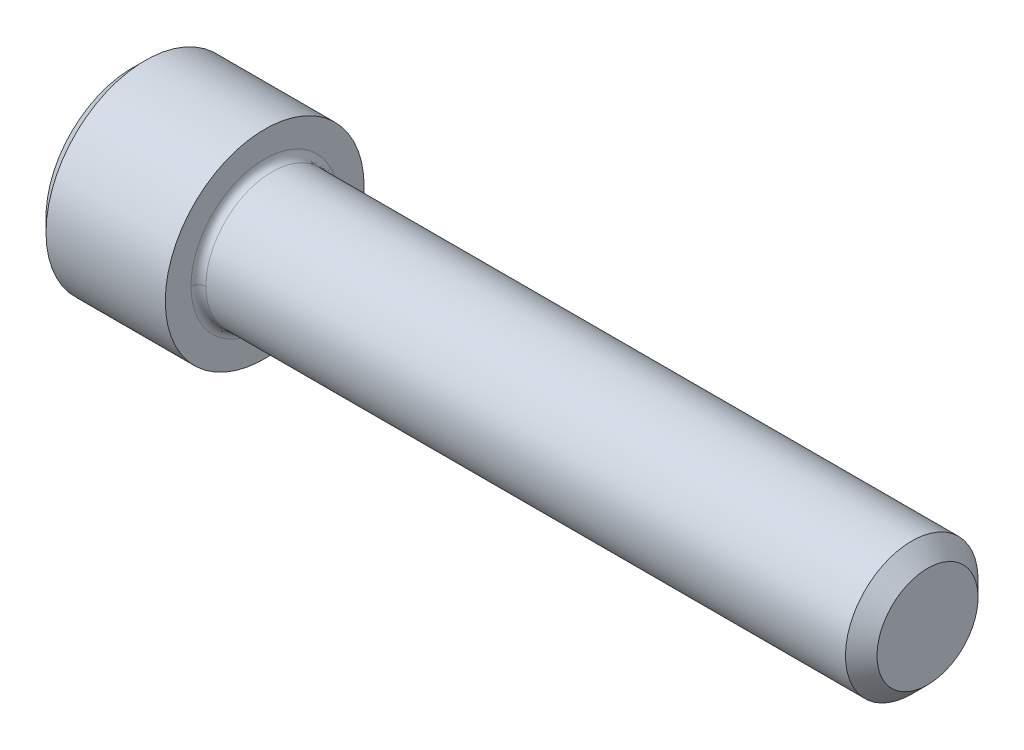
ISO-10303-21;
HEADER;
FILE_DESCRIPTION(('STEP AP214'),'2;1');
FILE_NAME('part.step','',(''),(''),'','','');
FILE_SCHEMA(('AUTOMOTIVE_DESIGN { 1 0 10303 214 1 1 1 1 }'));
ENDSEC;
DATA;
#1=APPLICATION_CONTEXT('core data for automotive mechanical design processes');
#2=APPLICATION_PROTOCOL_DEFINITION('international standard','automotive_design',2000,#1);
#3=PRODUCT_CONTEXT('',#1,'mechanical');
#4=PRODUCT('Part','Part','',(#3));
#5=PRODUCT_RELATED_PRODUCT_CATEGORY('part','',(#4));
#6=PRODUCT_DEFINITION_FORMATION('','',#4);
#7=PRODUCT_DEFINITION_CONTEXT('part definition',#1,'design');
#8=PRODUCT_DEFINITION('design','',#6,#7);
#9=PRODUCT_DEFINITION_SHAPE('','',#8);
#10=(LENGTH_UNIT() NAMED_UNIT(*) SI_UNIT(.MILLI.,.METRE.));
#11=(NAMED_UNIT(*) PLANE_ANGLE_UNIT() SI_UNIT($,.RADIAN.));
#12=(NAMED_UNIT(*) SI_UNIT($,.STERADIAN.) SOLID_ANGLE_UNIT());
#13=UNCERTAINTY_MEASURE_WITH_UNIT(LENGTH_MEASURE(1.E-05),#10,'distance_accuracy_value','');
#14=(GEOMETRIC_REPRESENTATION_CONTEXT(3) GLOBAL_UNCERTAINTY_ASSIGNED_CONTEXT((#13)) GLOBAL_UNIT_ASSIGNED_CONTEXT((#10,
#11,#12)) REPRESENTATION_CONTEXT('',''));
#15=CARTESIAN_POINT('',(0.,0.,0.));
#16=DIRECTION('',(0.,0.,1.));
#17=DIRECTION('',(1.,0.,0.));
#18=AXIS2_PLACEMENT_3D('',#15,#16,#17);
#19=CARTESIAN_POINT('',(38.1,-2.4483822,2.4483822));
#20=DIRECTION('',(1.,0.,0.));
#21=DIRECTION('',(0.,0.,-1.));
#22=AXIS2_PLACEMENT_3D('',#19,#20,#21);
#23=PLANE('',#22);
#24=CARTESIAN_POINT('',(38.1,0.,0.));
#25=DIRECTION('',(-1.,0.,0.));
#26=DIRECTION('',(0.,-1.,0.));
#27=AXIS2_PLACEMENT_3D('',#24,#25,#26);
#28=CIRCLE('',#27,2.41934999999998);
#29=CARTESIAN_POINT('',(38.1,-2.41934999999998,0.));
#30=VERTEX_POINT('',#29);
#31=EDGE_CURVE('E20',#30,#30,#28,.F.);
#32=ORIENTED_EDGE('',*,*,#31,.T.);
#33=EDGE_LOOP('',(#32));
#34=FACE_BOUND('',#33,.T.);
#35=ADVANCED_FACE('F16',(#34),#23,.T.);
#36=CARTESIAN_POINT('',(38.1,0.,0.));
#37=DIRECTION('',(-1.,0.,0.));
#38=DIRECTION('',(0.,-1.,0.));
#39=AXIS2_PLACEMENT_3D('',#36,#37,#38);
#40=CONICAL_SURFACE('',#39,2.41935,0.785398163397446);
#41=CARTESIAN_POINT('',(37.34435,0.,0.));
#42=DIRECTION('',(-1.,0.,0.));
#43=DIRECTION('',(0.,0.,1.));
#44=AXIS2_PLACEMENT_3D('',#41,#42,#43);
#45=CIRCLE('',#44,3.175);
#46=CARTESIAN_POINT('',(37.34435,0.,3.175));
#47=VERTEX_POINT('',#46);
#48=EDGE_CURVE('E239',#47,#47,#45,.F.);
#49=ORIENTED_EDGE('',*,*,#48,.T.);
#50=EDGE_LOOP('',(#49));
#51=FACE_BOUND('',#50,.T.);
#52=ORIENTED_EDGE('',*,*,#31,.F.);
#53=EDGE_LOOP('',(#52));
#54=FACE_BOUND('',#53,.T.);
#55=ADVANCED_FACE('F308',(#51,#54),#40,.T.);
#56=CARTESIAN_POINT('',(37.34435,0.,0.));
#57=DIRECTION('',(-1.,0.,0.));
#58=DIRECTION('',(0.,0.,1.));
#59=AXIS2_PLACEMENT_3D('',#56,#57,#58);
#60=CYLINDRICAL_SURFACE('',#59,3.175);
#61=CARTESIAN_POINT('',(6.70559999986134,0.,0.));
#62=DIRECTION('',(1.,0.,0.));
#63=DIRECTION('',(0.,0.,-1.));
#64=AXIS2_PLACEMENT_3D('',#61,#62,#63);
#65=CIRCLE('',#64,3.17500000019002);
#66=CARTESIAN_POINT('',(6.70559999986134,-3.25601692768088E-10,-3.17500000014251));
#67=VERTEX_POINT('',#66);
#68=CARTESIAN_POINT('',(6.705599999896,0.,3.17500000014251));
#69=VERTEX_POINT('',#68);
#70=EDGE_CURVE('E242',#67,#69,#65,.T.);
#71=ORIENTED_EDGE('',*,*,#70,.T.);
#72=CARTESIAN_POINT('',(6.70559999986134,0.,0.));
#73=DIRECTION('',(1.,0.,0.));
#74=DIRECTION('',(0.,0.,-1.));
#75=AXIS2_PLACEMENT_3D('',#72,#73,#74);
#76=CIRCLE('',#75,3.17500000019002);
#77=EDGE_CURVE('E231',#69,#67,#76,.T.);
#78=ORIENTED_EDGE('',*,*,#77,.T.);
#79=EDGE_LOOP('',(#71,#78));
#80=FACE_BOUND('',#79,.T.);
#81=ORIENTED_EDGE('',*,*,#48,.F.);
#82=EDGE_LOOP('',(#81));
#83=FACE_BOUND('',#82,.T.);
#84=ADVANCED_FACE('F216',(#80,#83),#60,.T.);
#85=CARTESIAN_POINT('',(6.351776519,0.,3.566100763));
#86=CARTESIAN_POINT('',(6.351776519,-7.132201526,3.566100763));
#87=CARTESIAN_POINT('',(6.351776519,-7.132201526,-3.566100763));
#88=CARTESIAN_POINT('',(6.351776519,0.,-3.566100763));
#89=CARTESIAN_POINT('',(6.327518818,0.,3.324332881));
#90=CARTESIAN_POINT('',(6.327518818,-6.648665762,3.324332881));
#91=CARTESIAN_POINT('',(6.327518818,-6.648665762,-3.324332881));
#92=CARTESIAN_POINT('',(6.327518818,0.,-3.324332881));
#93=CARTESIAN_POINT('',(6.499332881,0.,3.152518818));
#94=CARTESIAN_POINT('',(6.499332881,-6.305037635,3.152518818));
#95=CARTESIAN_POINT('',(6.499332881,-6.305037635,-3.152518818));
#96=CARTESIAN_POINT('',(6.499332881,0.,-3.152518818));
#97=CARTESIAN_POINT('',(6.741100763,0.,3.176776519));
#98=CARTESIAN_POINT('',(6.741100763,-6.353553038,3.176776519));
#99=CARTESIAN_POINT('',(6.741100763,-6.353553038,-3.176776519));
#100=CARTESIAN_POINT('',(6.741100763,0.,-3.176776519));
#101=(BOUNDED_SURFACE() B_SPLINE_SURFACE(3,3,((#85,#86,#87,#88),(#89,#90,#91,#92),(#93,#94,#95,
#96),(#97,#98,#99,#100)),.UNSPECIFIED.,.F.,.F.,.F.) B_SPLINE_SURFACE_WITH_KNOTS((4,4),(4,4),(0.,
1.),(0.,1.),.UNSPECIFIED.) GEOMETRIC_REPRESENTATION_ITEM() RATIONAL_B_SPLINE_SURFACE(((1.,
0.333333333333333,0.333333333333333,1.),(0.755320871117972,0.251773623705991,0.251773623705991,
0.755320871117972),(0.755320871117972,0.251773623705991,0.251773623705991,0.755320871117972),
(1.,0.333333333333333,0.333333333333333,1.))) REPRESENTATION_ITEM('') SURFACE());
#102=CARTESIAN_POINT('',(6.351776519,0.,3.566100763));
#103=CARTESIAN_POINT('',(6.327518818,0.,3.324332881));
#104=CARTESIAN_POINT('',(6.499332881,0.,3.152518818));
#105=CARTESIAN_POINT('',(6.741100763,0.,3.176776519));
#106=(BOUNDED_CURVE() B_SPLINE_CURVE(3,(#102,#103,#104,#105),.UNSPECIFIED.,.F.,
.F.) B_SPLINE_CURVE_WITH_KNOTS((4,4),(0.,1.),
.UNSPECIFIED.) CURVE() GEOMETRIC_REPRESENTATION_ITEM() RATIONAL_B_SPLINE_CURVE((1.,
0.755320871117972,0.755320871117972,1.)) REPRESENTATION_ITEM(''));
#107=CARTESIAN_POINT('',(6.35000000011401,0.,3.53060000088287));
#108=VERTEX_POINT('',#107);
#109=EDGE_CURVE('E188',#69,#108,#106,.F.);
#110=CARTESIAN_POINT('',(6.35000000019002,0.,3.53059999986352));
#111=CARTESIAN_POINT('',(6.35000000019002,-7.06119999971818,3.53059999986352));
#112=CARTESIAN_POINT('',(6.35000000019002,-7.06119999971818,-3.53059999986352));
#113=CARTESIAN_POINT('',(6.35000000019002,0.,-3.53059999986352));
#114=(BOUNDED_CURVE() B_SPLINE_CURVE(3,(#110,#111,#112,#113),.UNSPECIFIED.,.F.,
.F.) B_SPLINE_CURVE_WITH_KNOTS((4,4),(0.,1.),
.UNSPECIFIED.) CURVE() GEOMETRIC_REPRESENTATION_ITEM() RATIONAL_B_SPLINE_CURVE((0.956578302168424,
0.318859434056141,0.318859434056141,0.956578302168424)) REPRESENTATION_ITEM(''));
#115=CARTESIAN_POINT('',(6.35000000011401,0.,-3.53060000088287));
#116=VERTEX_POINT('',#115);
#117=EDGE_CURVE('E251',#116,#108,#114,.F.);
#118=CARTESIAN_POINT('',(6.351776519,0.,-3.566100763));
#119=CARTESIAN_POINT('',(6.327518818,0.,-3.324332881));
#120=CARTESIAN_POINT('',(6.499332881,0.,-3.152518818));
#121=CARTESIAN_POINT('',(6.741100763,0.,-3.176776519));
#122=(BOUNDED_CURVE() B_SPLINE_CURVE(3,(#118,#119,#120,#121),.UNSPECIFIED.,.F.,
.F.) B_SPLINE_CURVE_WITH_KNOTS((4,4),(0.,1.),
.UNSPECIFIED.) CURVE() GEOMETRIC_REPRESENTATION_ITEM() RATIONAL_B_SPLINE_CURVE((1.,
0.755320871117972,0.755320871117972,1.)) REPRESENTATION_ITEM(''));
#123=EDGE_CURVE('E238',#116,#67,#122,.T.);
#124=ORIENTED_EDGE('',*,*,#109,.T.);
#125=ORIENTED_EDGE('',*,*,#117,.F.);
#126=ORIENTED_EDGE('',*,*,#123,.T.);
#127=ORIENTED_EDGE('',*,*,#77,.F.);
#128=EDGE_LOOP('',(#124,#125,#126,#127));
#129=FACE_BOUND('',#128,.T.);
#130=ADVANCED_FACE('F203',(#129),#101,.F.);
#131=CARTESIAN_POINT('',(6.351776519,0.,-3.566100763));
#132=CARTESIAN_POINT('',(6.351776519,7.132201526,-3.566100763));
#133=CARTESIAN_POINT('',(6.351776519,7.132201526,3.566100763));
#134=CARTESIAN_POINT('',(6.351776519,0.,3.566100763));
#135=CARTESIAN_POINT('',(6.327518818,0.,-3.324332881));
#136=CARTESIAN_POINT('',(6.327518818,6.648665762,-3.324332881));
#137=CARTESIAN_POINT('',(6.327518818,6.648665762,3.324332881));
#138=CARTESIAN_POINT('',(6.327518818,0.,3.324332881));
#139=CARTESIAN_POINT('',(6.499332881,0.,-3.152518818));
#140=CARTESIAN_POINT('',(6.499332881,6.305037635,-3.152518818));
#141=CARTESIAN_POINT('',(6.499332881,6.305037635,3.152518818));
#142=CARTESIAN_POINT('',(6.499332881,0.,3.152518818));
#143=CARTESIAN_POINT('',(6.741100763,0.,-3.176776519));
#144=CARTESIAN_POINT('',(6.741100763,6.353553038,-3.176776519));
#145=CARTESIAN_POINT('',(6.741100763,6.353553038,3.176776519));
#146=CARTESIAN_POINT('',(6.741100763,0.,3.176776519));
#147=(BOUNDED_SURFACE() B_SPLINE_SURFACE(3,3,((#131,#132,#133,#134),(#135,#136,#137,#138),(#139,
#140,#141,#142),(#143,#144,#145,#146)),.UNSPECIFIED.,.F.,.F.,
.F.) B_SPLINE_SURFACE_WITH_KNOTS((4,4),(4,4),(0.,1.),(0.,1.),
.UNSPECIFIED.) GEOMETRIC_REPRESENTATION_ITEM() RATIONAL_B_SPLINE_SURFACE(((1.,0.333333333333333,
0.333333333333333,1.),(0.755320871117972,0.251773623705991,0.251773623705991,0.755320871117972),
(0.755320871117972,0.251773623705991,0.251773623705991,0.755320871117972),(1.,0.333333333333333,
0.333333333333333,1.))) REPRESENTATION_ITEM('') SURFACE());
#148=CARTESIAN_POINT('',(6.35000000019002,0.,-3.53059999986352));
#149=CARTESIAN_POINT('',(6.35000000019002,7.06119999971819,-3.53059999986352));
#150=CARTESIAN_POINT('',(6.35000000019002,7.06119999971819,3.53059999986352));
#151=CARTESIAN_POINT('',(6.35000000019002,0.,3.53059999986352));
#152=(BOUNDED_CURVE() B_SPLINE_CURVE(3,(#148,#149,#150,#151),.UNSPECIFIED.,.F.,
.F.) B_SPLINE_CURVE_WITH_KNOTS((4,4),(0.,1.),
.UNSPECIFIED.) CURVE() GEOMETRIC_REPRESENTATION_ITEM() RATIONAL_B_SPLINE_CURVE((0.956578302168424,
0.318859434056141,0.318859434056141,0.956578302168424)) REPRESENTATION_ITEM(''));
#153=EDGE_CURVE('E183',#108,#116,#152,.F.);
#154=ORIENTED_EDGE('',*,*,#70,.F.);
#155=ORIENTED_EDGE('',*,*,#123,.F.);
#156=ORIENTED_EDGE('',*,*,#153,.F.);
#157=ORIENTED_EDGE('',*,*,#109,.F.);
#158=EDGE_LOOP('',(#154,#155,#156,#157));
#159=FACE_BOUND('',#158,.T.);
#160=ADVANCED_FACE('F190',(#159),#147,.F.);
#161=CARTESIAN_POINT('',(6.35,-4.81965,4.81965));
#162=DIRECTION('',(1.,0.,0.));
#163=DIRECTION('',(0.,0.,-1.));
#164=AXIS2_PLACEMENT_3D('',#161,#162,#163);
#165=PLANE('',#164);
#166=ORIENTED_EDGE('',*,*,#117,.T.);
#167=ORIENTED_EDGE('',*,*,#153,.T.);
#168=EDGE_LOOP('',(#166,#167));
#169=FACE_BOUND('',#168,.T.);
#170=CARTESIAN_POINT('',(6.35,0.,0.));
#171=DIRECTION('',(-1.,0.,0.));
#172=DIRECTION('',(0.,0.,1.));
#173=AXIS2_PLACEMENT_3D('',#170,#171,#172);
#174=CIRCLE('',#173,4.7625);
#175=CARTESIAN_POINT('',(6.35,0.,4.7625));
#176=VERTEX_POINT('',#175);
#177=EDGE_CURVE('E177',#176,#176,#174,.F.);
#178=ORIENTED_EDGE('',*,*,#177,.T.);
#179=EDGE_LOOP('',(#178));
#180=FACE_BOUND('',#179,.T.);
#181=ADVANCED_FACE('F202',(#169,#180),#165,.T.);
#182=CARTESIAN_POINT('',(6.35,0.,0.));
#183=DIRECTION('',(-1.,0.,0.));
#184=DIRECTION('',(0.,0.,1.));
#185=AXIS2_PLACEMENT_3D('',#182,#183,#184);
#186=CYLINDRICAL_SURFACE('',#185,4.7625);
#187=CARTESIAN_POINT('',(0.634999999999941,0.,0.));
#188=DIRECTION('',(1.,0.,0.));
#189=DIRECTION('',(0.,0.,-1.));
#190=AXIS2_PLACEMENT_3D('',#187,#188,#189);
#191=CIRCLE('',#190,4.7625);
#192=CARTESIAN_POINT('',(0.635,0.,-4.7625));
#193=VERTEX_POINT('',#192);
#194=EDGE_CURVE('E155',#193,#193,#191,.T.);
#195=ORIENTED_EDGE('',*,*,#194,.T.);
#196=EDGE_LOOP('',(#195));
#197=FACE_BOUND('',#196,.T.);
#198=ORIENTED_EDGE('',*,*,#177,.F.);
#199=EDGE_LOOP('',(#198));
#200=FACE_BOUND('',#199,.T.);
#201=ADVANCED_FACE('F204',(#197,#200),#186,.T.);
#202=CARTESIAN_POINT('',(0.,0.,0.));
#203=DIRECTION('',(1.,0.,0.));
#204=DIRECTION('',(0.,0.,-1.));
#205=AXIS2_PLACEMENT_3D('',#202,#203,#204);
#206=CONICAL_SURFACE('',#205,4.1275,0.785398163397449);
#207=ORIENTED_EDGE('',*,*,#194,.F.);
#208=EDGE_LOOP('',(#207));
#209=FACE_BOUND('',#208,.T.);
#210=CARTESIAN_POINT('',(0.,0.,0.));
#211=DIRECTION('',(1.,0.,0.));
#212=DIRECTION('',(0.,0.,-1.));
#213=AXIS2_PLACEMENT_3D('',#210,#211,#212);
#214=CIRCLE('',#213,4.1275);
#215=CARTESIAN_POINT('',(0.,0.,-4.1275));
#216=VERTEX_POINT('',#215);
#217=EDGE_CURVE('E297',#216,#216,#214,.F.);
#218=ORIENTED_EDGE('',*,*,#217,.F.);
#219=EDGE_LOOP('',(#218));
#220=FACE_BOUND('',#219,.T.);
#221=ADVANCED_FACE('F326',(#209,#220),#206,.T.);
#222=CARTESIAN_POINT('',(0.,1.374815329,2.38125));
#223=DIRECTION('',(0.,-0.866025403864407,-0.499999999861491));
#224=DIRECTION('',(0.,0.499999999861491,-0.866025403864407));
#225=AXIS2_PLACEMENT_3D('',#222,#223,#224);
#226=PLANE('',#225);
#227=DIRECTION('',(0.,-0.499999999861491,0.866025403864407));
#228=VECTOR('',#227,1.);
#229=CARTESIAN_POINT('',(3.048,2.062222993,1.190625));
#230=LINE('',#229,#228);
#231=CARTESIAN_POINT('',(3.048,2.06222299282923,1.1906250000894));
#232=VERTEX_POINT('',#231);
#233=CARTESIAN_POINT('',(3.048,1.374815329,2.38125));
#234=VERTEX_POINT('',#233);
#235=EDGE_CURVE('E154',#232,#234,#230,.T.);
#236=ORIENTED_EDGE('',*,*,#235,.T.);
#237=DIRECTION('',(-1.,0.,0.));
#238=VECTOR('',#237,1.);
#239=CARTESIAN_POINT('',(1.524,1.374815329,2.38125));
#240=LINE('',#239,#238);
#241=CARTESIAN_POINT('',(0.,1.37481533048075,2.38125000056007));
#242=VERTEX_POINT('',#241);
#243=EDGE_CURVE('E161',#234,#242,#240,.T.);
#244=ORIENTED_EDGE('',*,*,#243,.T.);
#245=DIRECTION('',(0.,-0.499999998545759,0.866025404624045));
#246=VECTOR('',#245,1.);
#247=CARTESIAN_POINT('',(0.,2.74963065556894,0.));
#248=LINE('',#247,#246);
#249=CARTESIAN_POINT('',(0.,2.74963065601615,-1.54916944070139E-10));
#250=VERTEX_POINT('',#249);
#251=EDGE_CURVE('E295',#250,#242,#248,.T.);
#252=ORIENTED_EDGE('',*,*,#251,.F.);
#253=DIRECTION('',(1.,0.,0.));
#254=VECTOR('',#253,1.);
#255=CARTESIAN_POINT('',(1.524,2.749630657,0.));
#256=LINE('',#255,#254);
#257=CARTESIAN_POINT('',(3.048,2.749630657,0.));
#258=VERTEX_POINT('',#257);
#259=EDGE_CURVE('E75',#250,#258,#256,.T.);
#260=ORIENTED_EDGE('',*,*,#259,.T.);
#261=DIRECTION('',(0.,-0.499999999861491,0.866025403864407));
#262=VECTOR('',#261,1.);
#263=CARTESIAN_POINT('',(3.048,2.062222993,1.190625));
#264=LINE('',#263,#262);
#265=EDGE_CURVE('E152',#258,#232,#264,.T.);
#266=ORIENTED_EDGE('',*,*,#265,.T.);
#267=EDGE_LOOP('',(#236,#244,#252,#260,#266));
#268=FACE_BOUND('',#267,.T.);
#269=ADVANCED_FACE('F267',(#268),#226,.T.);
#270=CARTESIAN_POINT('',(0.,1.374815329,2.38125));
#271=DIRECTION('',(0.,0.,1.));
#272=DIRECTION('',(0.,-1.,0.));
#273=AXIS2_PLACEMENT_3D('',#270,#271,#272);
#274=PLANE('',#273);
#275=ORIENTED_EDGE('',*,*,#243,.F.);
#276=DIRECTION('',(0.,1.,0.));
#277=VECTOR('',#276,1.);
#278=CARTESIAN_POINT('',(3.048,0.,2.38125));
#279=LINE('',#278,#277);
#280=CARTESIAN_POINT('',(3.048,-2.1382107769592E-10,2.38125));
#281=VERTEX_POINT('',#280);
#282=EDGE_CURVE('E165',#281,#234,#279,.T.);
#283=ORIENTED_EDGE('',*,*,#282,.F.);
#284=DIRECTION('',(0.,1.,0.));
#285=VECTOR('',#284,1.);
#286=CARTESIAN_POINT('',(3.048,0.,2.38125));
#287=LINE('',#286,#285);
#288=CARTESIAN_POINT('',(3.048,-1.374815329,2.38125));
#289=VERTEX_POINT('',#288);
#290=EDGE_CURVE('E125',#289,#281,#287,.T.);
#291=ORIENTED_EDGE('',*,*,#290,.F.);
#292=DIRECTION('',(1.,0.,0.));
#293=VECTOR('',#292,1.);
#294=CARTESIAN_POINT('',(1.524,-1.374815329,2.38125));
#295=LINE('',#294,#293);
#296=CARTESIAN_POINT('',(0.,-1.37481533048075,2.38125000056007));
#297=VERTEX_POINT('',#296);
#298=EDGE_CURVE('E120',#297,#289,#295,.T.);
#299=ORIENTED_EDGE('',*,*,#298,.F.);
#300=DIRECTION('',(0.,-1.,0.));
#301=VECTOR('',#300,1.);
#302=CARTESIAN_POINT('',(0.,0.,2.38125000074676));
#303=LINE('',#302,#301);
#304=EDGE_CURVE('E294',#242,#297,#303,.T.);
#305=ORIENTED_EDGE('',*,*,#304,.F.);
#306=EDGE_LOOP('',(#275,#283,#291,#299,#305));
#307=FACE_BOUND('',#306,.T.);
#308=ADVANCED_FACE('F333',(#307),#274,.F.);
#309=CARTESIAN_POINT('',(0.,-2.749630657,0.));
#310=DIRECTION('',(0.,0.866025403864407,-0.499999999861491));
#311=DIRECTION('',(0.,0.499999999861491,0.866025403864407));
#312=AXIS2_PLACEMENT_3D('',#309,#310,#311);
#313=PLANE('',#312);
#314=DIRECTION('',(0.,-0.499999999861491,-0.866025403864407));
#315=VECTOR('',#314,1.);
#316=CARTESIAN_POINT('',(3.048,-2.062222993,1.190625));
#317=LINE('',#316,#315);
#318=CARTESIAN_POINT('',(3.048,-2.06222299293614,1.19062499990422));
#319=VERTEX_POINT('',#318);
#320=CARTESIAN_POINT('',(3.048,-2.749630657,0.));
#321=VERTEX_POINT('',#320);
#322=EDGE_CURVE('E91',#319,#321,#317,.T.);
#323=ORIENTED_EDGE('',*,*,#322,.T.);
#324=DIRECTION('',(1.,0.,0.));
#325=VECTOR('',#324,1.);
#326=CARTESIAN_POINT('',(1.524,-2.749630657,0.));
#327=LINE('',#326,#325);
#328=CARTESIAN_POINT('',(0.,-2.74963065601615,-1.54917203197547E-10));
#329=VERTEX_POINT('',#328);
#330=EDGE_CURVE('E494',#329,#321,#327,.T.);
#331=ORIENTED_EDGE('',*,*,#330,.F.);
#332=DIRECTION('',(0.,-0.499999998545759,-0.866025404624045));
#333=VECTOR('',#332,1.);
#334=CARTESIAN_POINT('',(0.,-1.3748153319615,2.38125000074676));
#335=LINE('',#334,#333);
#336=EDGE_CURVE('E292',#297,#329,#335,.T.);
#337=ORIENTED_EDGE('',*,*,#336,.F.);
#338=ORIENTED_EDGE('',*,*,#298,.T.);
#339=DIRECTION('',(0.,-0.499999999861491,-0.866025403864407));
#340=VECTOR('',#339,1.);
#341=CARTESIAN_POINT('',(3.048,-2.062222993,1.190625));
#342=LINE('',#341,#340);
#343=EDGE_CURVE('E115',#289,#319,#342,.T.);
#344=ORIENTED_EDGE('',*,*,#343,.T.);
#345=EDGE_LOOP('',(#323,#331,#337,#338,#344));
#346=FACE_BOUND('',#345,.T.);
#347=ADVANCED_FACE('F117',(#346),#313,.T.);
#348=CARTESIAN_POINT('',(0.,1.374815329,-2.38125));
#349=DIRECTION('',(0.,0.866025403864407,-0.499999999861491));
#350=DIRECTION('',(0.,0.499999999861491,0.866025403864407));
#351=AXIS2_PLACEMENT_3D('',#348,#349,#350);
#352=PLANE('',#351);
#353=DIRECTION('',(1.,0.,0.));
#354=VECTOR('',#353,1.);
#355=CARTESIAN_POINT('',(1.524,1.374815329,-2.38125));
#356=LINE('',#355,#354);
#357=CARTESIAN_POINT('',(0.,1.37481533069632,-2.38125));
#358=VERTEX_POINT('',#357);
#359=CARTESIAN_POINT('',(3.048,1.37481532883667,-2.38125));
#360=VERTEX_POINT('',#359);
#361=EDGE_CURVE('E289',#358,#360,#356,.T.);
#362=ORIENTED_EDGE('',*,*,#361,.T.);
#363=DIRECTION('',(0.,-0.499999999861491,-0.866025403864407));
#364=VECTOR('',#363,1.);
#365=CARTESIAN_POINT('',(3.048,2.062222993,-1.190625));
#366=LINE('',#365,#364);
#367=CARTESIAN_POINT('',(3.048,2.06222299311492,-1.19062499959457));
#368=VERTEX_POINT('',#367);
#369=EDGE_CURVE('E149',#368,#360,#366,.T.);
#370=ORIENTED_EDGE('',*,*,#369,.F.);
#371=DIRECTION('',(0.,-0.499999999861491,-0.866025403864407));
#372=VECTOR('',#371,1.);
#373=CARTESIAN_POINT('',(3.048,2.062222993,-1.190625));
#374=LINE('',#373,#372);
#375=EDGE_CURVE('E139',#258,#368,#374,.T.);
#376=ORIENTED_EDGE('',*,*,#375,.F.);
#377=ORIENTED_EDGE('',*,*,#259,.F.);
#378=DIRECTION('',(0.,0.49999999854576,0.866025404624045));
#379=VECTOR('',#378,1.);
#380=CARTESIAN_POINT('',(0.,1.3748153319615,-2.38125000074676));
#381=LINE('',#380,#379);
#382=EDGE_CURVE('E287',#358,#250,#381,.T.);
#383=ORIENTED_EDGE('',*,*,#382,.F.);
#384=EDGE_LOOP('',(#362,#370,#376,#377,#383));
#385=FACE_BOUND('',#384,.T.);
#386=ADVANCED_FACE('F352',(#385),#352,.F.);
#387=CARTESIAN_POINT('',(0.,-1.374815329,-2.38125));
#388=DIRECTION('',(0.,0.866025403864407,0.499999999861491));
#389=DIRECTION('',(0.,-0.499999999861491,0.866025403864407));
#390=AXIS2_PLACEMENT_3D('',#387,#388,#389);
#391=PLANE('',#390);
#392=DIRECTION('',(0.,0.499999999861491,-0.866025403864407));
#393=VECTOR('',#392,1.);
#394=CARTESIAN_POINT('',(3.048,-2.062222993,-1.190625));
#395=LINE('',#394,#393);
#396=CARTESIAN_POINT('',(3.048,-2.06222299300801,-1.19062499977975));
#397=VERTEX_POINT('',#396);
#398=CARTESIAN_POINT('',(3.048,-1.37481532897958,-2.38125000003536));
#399=VERTEX_POINT('',#398);
#400=EDGE_CURVE('E299',#397,#399,#395,.T.);
#401=ORIENTED_EDGE('',*,*,#400,.T.);
#402=DIRECTION('',(-1.,0.,0.));
#403=VECTOR('',#402,1.);
#404=CARTESIAN_POINT('',(1.524,-1.374815329,-2.38125));
#405=LINE('',#404,#403);
#406=CARTESIAN_POINT('',(0.,-1.37481533069632,-2.38125));
#407=VERTEX_POINT('',#406);
#408=EDGE_CURVE('E476',#399,#407,#405,.T.);
#409=ORIENTED_EDGE('',*,*,#408,.T.);
#410=DIRECTION('',(0.,0.49999999854576,-0.866025404624045));
#411=VECTOR('',#410,1.);
#412=CARTESIAN_POINT('',(0.,-2.74963065556894,0.));
#413=LINE('',#412,#411);
#414=EDGE_CURVE('E290',#329,#407,#413,.T.);
#415=ORIENTED_EDGE('',*,*,#414,.F.);
#416=ORIENTED_EDGE('',*,*,#330,.T.);
#417=DIRECTION('',(0.,0.499999999861491,-0.866025403864407));
#418=VECTOR('',#417,1.);
#419=CARTESIAN_POINT('',(3.048,-2.062222993,-1.190625));
#420=LINE('',#419,#418);
#421=EDGE_CURVE('E83',#321,#397,#420,.T.);
#422=ORIENTED_EDGE('',*,*,#421,.T.);
#423=EDGE_LOOP('',(#401,#409,#415,#416,#422));
#424=FACE_BOUND('',#423,.T.);
#425=ADVANCED_FACE('F343',(#424),#391,.T.);
#426=CARTESIAN_POINT('',(0.,-4.17703,-4.17703));
#427=DIRECTION('',(-1.,0.,0.));
#428=DIRECTION('',(0.,0.,1.));
#429=AXIS2_PLACEMENT_3D('',#426,#427,#428);
#430=PLANE('',#429);
#431=DIRECTION('',(0.,1.,0.));
#432=VECTOR('',#431,1.);
#433=CARTESIAN_POINT('',(0.,0.,-2.38125));
#434=LINE('',#433,#432);
#435=EDGE_CURVE('E473',#407,#358,#434,.T.);
#436=ORIENTED_EDGE('',*,*,#435,.T.);
#437=ORIENTED_EDGE('',*,*,#382,.T.);
#438=ORIENTED_EDGE('',*,*,#251,.T.);
#439=ORIENTED_EDGE('',*,*,#304,.T.);
#440=ORIENTED_EDGE('',*,*,#336,.T.);
#441=ORIENTED_EDGE('',*,*,#414,.T.);
#442=EDGE_LOOP('',(#436,#437,#438,#439,#440,#441));
#443=FACE_BOUND('',#442,.T.);
#444=ORIENTED_EDGE('',*,*,#217,.T.);
#445=EDGE_LOOP('',(#444));
#446=FACE_BOUND('',#445,.T.);
#447=ADVANCED_FACE('F340',(#443,#446),#430,.T.);
#448=CARTESIAN_POINT('',(0.,-1.374815329,-2.38125));
#449=DIRECTION('',(0.,0.,-1.));
#450=DIRECTION('',(0.,1.,0.));
#451=AXIS2_PLACEMENT_3D('',#448,#449,#450);
#452=PLANE('',#451);
#453=ORIENTED_EDGE('',*,*,#408,.F.);
#454=DIRECTION('',(0.,-1.,0.));
#455=VECTOR('',#454,1.);
#456=CARTESIAN_POINT('',(3.048,0.,-2.38125));
#457=LINE('',#456,#455);
#458=CARTESIAN_POINT('',(3.048,-4.88402575887903E-10,-2.38125));
#459=VERTEX_POINT('',#458);
#460=EDGE_CURVE('E35',#459,#399,#457,.T.);
#461=ORIENTED_EDGE('',*,*,#460,.F.);
#462=DIRECTION('',(0.,-1.,0.));
#463=VECTOR('',#462,1.);
#464=CARTESIAN_POINT('',(3.048,1.0311114965,-2.38125));
#465=LINE('',#464,#463);
#466=EDGE_CURVE('E286',#360,#459,#465,.T.);
#467=ORIENTED_EDGE('',*,*,#466,.F.);
#468=ORIENTED_EDGE('',*,*,#361,.F.);
#469=ORIENTED_EDGE('',*,*,#435,.F.);
#470=EDGE_LOOP('',(#453,#461,#467,#468,#469));
#471=FACE_BOUND('',#470,.T.);
#472=ADVANCED_FACE('F342',(#471),#452,.F.);
#473=CARTESIAN_POINT('',(3.048,-0.012373338,1.18348125));
#474=DIRECTION('',(-1.,0.,0.));
#475=DIRECTION('',(0.,0.,1.));
#476=AXIS2_PLACEMENT_3D('',#473,#474,#475);
#477=PLANE('',#476);
#478=ORIENTED_EDGE('',*,*,#282,.T.);
#479=ORIENTED_EDGE('',*,*,#235,.F.);
#480=CARTESIAN_POINT('',(3.048,0.,0.));
#481=DIRECTION('',(-1.,0.,0.));
#482=DIRECTION('',(0.,0.,1.));
#483=AXIS2_PLACEMENT_3D('',#480,#481,#482);
#484=CIRCLE('',#483,2.38125);
#485=EDGE_CURVE('E284',#281,#232,#484,.T.);
#486=ORIENTED_EDGE('',*,*,#485,.F.);
#487=EDGE_LOOP('',(#478,#479,#486));
#488=FACE_BOUND('',#487,.T.);
#489=ADVANCED_FACE('F350',(#488),#477,.T.);
#490=CARTESIAN_POINT('',(3.048,2.058098547,-1.2049125));
#491=DIRECTION('',(-1.,0.,0.));
#492=DIRECTION('',(0.,0.,1.));
#493=AXIS2_PLACEMENT_3D('',#490,#491,#492);
#494=PLANE('',#493);
#495=ORIENTED_EDGE('',*,*,#265,.F.);
#496=ORIENTED_EDGE('',*,*,#375,.T.);
#497=CARTESIAN_POINT('',(3.048,0.,0.));
#498=DIRECTION('',(-1.,0.,0.));
#499=DIRECTION('',(0.,0.,1.));
#500=AXIS2_PLACEMENT_3D('',#497,#498,#499);
#501=CIRCLE('',#500,2.38125);
#502=EDGE_CURVE('E281',#232,#368,#501,.T.);
#503=ORIENTED_EDGE('',*,*,#502,.F.);
#504=EDGE_LOOP('',(#495,#496,#503));
#505=FACE_BOUND('',#504,.T.);
#506=ADVANCED_FACE('F359',(#505),#494,.T.);
#507=CARTESIAN_POINT('',(3.048,-0.012373338,-2.38125));
#508=DIRECTION('',(-1.,0.,0.));
#509=DIRECTION('',(0.,0.,1.));
#510=AXIS2_PLACEMENT_3D('',#507,#508,#509);
#511=PLANE('',#510);
#512=ORIENTED_EDGE('',*,*,#369,.T.);
#513=ORIENTED_EDGE('',*,*,#466,.T.);
#514=CARTESIAN_POINT('',(3.048,0.,0.));
#515=DIRECTION('',(-1.,0.,0.));
#516=DIRECTION('',(0.,0.,1.));
#517=AXIS2_PLACEMENT_3D('',#514,#515,#516);
#518=CIRCLE('',#517,2.38125);
#519=EDGE_CURVE('E279',#368,#459,#518,.T.);
#520=ORIENTED_EDGE('',*,*,#519,.F.);
#521=EDGE_LOOP('',(#512,#513,#520));
#522=FACE_BOUND('',#521,.T.);
#523=ADVANCED_FACE('F363',(#522),#511,.T.);
#524=CARTESIAN_POINT('',(3.048,-2.074596331,-2.38125));
#525=DIRECTION('',(-1.,0.,0.));
#526=DIRECTION('',(0.,0.,1.));
#527=AXIS2_PLACEMENT_3D('',#524,#525,#526);
#528=PLANE('',#527);
#529=ORIENTED_EDGE('',*,*,#460,.T.);
#530=ORIENTED_EDGE('',*,*,#400,.F.);
#531=CARTESIAN_POINT('',(3.048,0.,0.));
#532=DIRECTION('',(-1.,0.,0.));
#533=DIRECTION('',(0.,0.,1.));
#534=AXIS2_PLACEMENT_3D('',#531,#532,#533);
#535=CIRCLE('',#534,2.38125);
#536=EDGE_CURVE('E133',#459,#397,#535,.T.);
#537=ORIENTED_EDGE('',*,*,#536,.F.);
#538=EDGE_LOOP('',(#529,#530,#537));
#539=FACE_BOUND('',#538,.T.);
#540=ADVANCED_FACE('F367',(#539),#528,.T.);
#541=CARTESIAN_POINT('',(3.048,-2.753755103,-1.2049125));
#542=DIRECTION('',(-1.,0.,0.));
#543=DIRECTION('',(0.,0.,1.));
#544=AXIS2_PLACEMENT_3D('',#541,#542,#543);
#545=PLANE('',#544);
#546=ORIENTED_EDGE('',*,*,#421,.F.);
#547=ORIENTED_EDGE('',*,*,#322,.F.);
#548=CARTESIAN_POINT('',(3.048,0.,0.));
#549=DIRECTION('',(-1.,0.,0.));
#550=DIRECTION('',(0.,0.,1.));
#551=AXIS2_PLACEMENT_3D('',#548,#549,#550);
#552=CIRCLE('',#551,2.38125);
#553=EDGE_CURVE('E26',#397,#319,#552,.T.);
#554=ORIENTED_EDGE('',*,*,#553,.F.);
#555=EDGE_LOOP('',(#546,#547,#554));
#556=FACE_BOUND('',#555,.T.);
#557=ADVANCED_FACE('F137',(#556),#545,.T.);
#558=CARTESIAN_POINT('',(3.048,-2.074596331,1.18348125));
#559=DIRECTION('',(-1.,0.,0.));
#560=DIRECTION('',(0.,0.,1.));
#561=AXIS2_PLACEMENT_3D('',#558,#559,#560);
#562=PLANE('',#561);
#563=ORIENTED_EDGE('',*,*,#343,.F.);
#564=ORIENTED_EDGE('',*,*,#290,.T.);
#565=CARTESIAN_POINT('',(3.048,0.,0.));
#566=DIRECTION('',(-1.,0.,0.));
#567=DIRECTION('',(0.,0.,1.));
#568=AXIS2_PLACEMENT_3D('',#565,#566,#567);
#569=CIRCLE('',#568,2.38125);
#570=EDGE_CURVE('E10',#319,#281,#569,.T.);
#571=ORIENTED_EDGE('',*,*,#570,.F.);
#572=EDGE_LOOP('',(#563,#564,#571));
#573=FACE_BOUND('',#572,.T.);
#574=ADVANCED_FACE('F18',(#573),#562,.T.);
#575=CARTESIAN_POINT('',(4.422815329,0.,0.));
#576=DIRECTION('',(-1.,0.,0.));
#577=DIRECTION('',(0.,0.,1.));
#578=AXIS2_PLACEMENT_3D('',#575,#576,#577);
#579=CONICAL_SURFACE('',#578,0.,1.04719755104157);
#580=CARTESIAN_POINT('',(4.422815329,0.,0.));
#581=VERTEX_POINT('',#580);
#582=VERTEX_LOOP('',#581);
#583=FACE_BOUND('',#582,.T.);
#584=ORIENTED_EDGE('',*,*,#553,.T.);
#585=ORIENTED_EDGE('',*,*,#570,.T.);
#586=ORIENTED_EDGE('',*,*,#485,.T.);
#587=ORIENTED_EDGE('',*,*,#502,.T.);
#588=ORIENTED_EDGE('',*,*,#519,.T.);
#589=ORIENTED_EDGE('',*,*,#536,.T.);
#590=EDGE_LOOP('',(#584,#585,#586,#587,#588,#589));
#591=FACE_BOUND('',#590,.T.);
#592=ADVANCED_FACE('F130',(#583,#591),#579,.F.);
#593=CLOSED_SHELL('',(#35,#55,#84,#130,#160,#181,#201,#221,#269,#308,#347,#386,#425,#447,#472,
#489,#506,#523,#540,#557,#574,#592));
#594=MANIFOLD_SOLID_BREP('B1',#593);
#595=ADVANCED_BREP_SHAPE_REPRESENTATION('',(#18,#594),#14);
#596=SHAPE_DEFINITION_REPRESENTATION(#9,#595);
ENDSEC;
END-ISO-10303-21;
